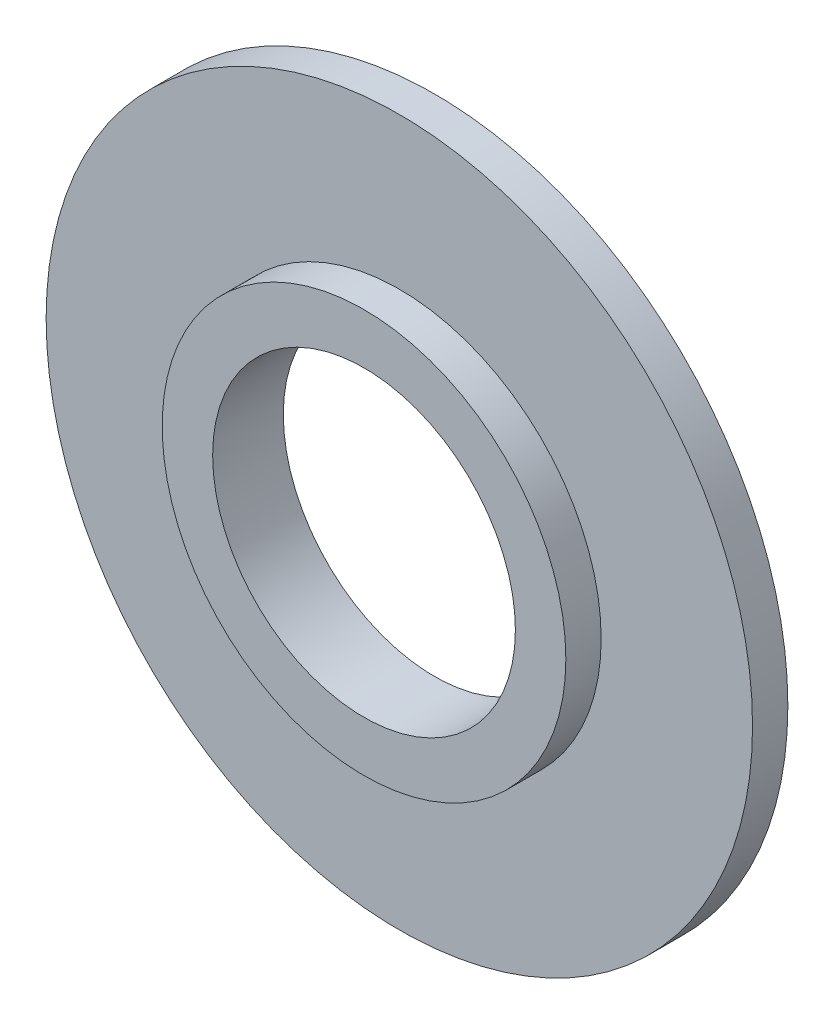
ISO-10303-21;
HEADER;
FILE_DESCRIPTION(('STEP AP214'),'2;1');
FILE_NAME('part.step','',(''),(''),'','','');
FILE_SCHEMA(('AUTOMOTIVE_DESIGN { 1 0 10303 214 1 1 1 1 }'));
ENDSEC;
DATA;
#1=APPLICATION_CONTEXT('core data for automotive mechanical design processes');
#2=APPLICATION_PROTOCOL_DEFINITION('international standard','automotive_design',2000,#1);
#3=PRODUCT_CONTEXT('',#1,'mechanical');
#4=PRODUCT('Part','Part','',(#3));
#5=PRODUCT_RELATED_PRODUCT_CATEGORY('part','',(#4));
#6=PRODUCT_DEFINITION_FORMATION('','',#4);
#7=PRODUCT_DEFINITION_CONTEXT('part definition',#1,'design');
#8=PRODUCT_DEFINITION('design','',#6,#7);
#9=PRODUCT_DEFINITION_SHAPE('','',#8);
#10=(LENGTH_UNIT() NAMED_UNIT(*) SI_UNIT(.MILLI.,.METRE.));
#11=(NAMED_UNIT(*) PLANE_ANGLE_UNIT() SI_UNIT($,.RADIAN.));
#12=(NAMED_UNIT(*) SI_UNIT($,.STERADIAN.) SOLID_ANGLE_UNIT());
#13=UNCERTAINTY_MEASURE_WITH_UNIT(LENGTH_MEASURE(1.E-05),#10,'distance_accuracy_value','');
#14=(GEOMETRIC_REPRESENTATION_CONTEXT(3) GLOBAL_UNCERTAINTY_ASSIGNED_CONTEXT((#13)) GLOBAL_UNIT_ASSIGNED_CONTEXT((#10,
#11,#12)) REPRESENTATION_CONTEXT('',''));
#15=CARTESIAN_POINT('',(0.,0.,0.));
#16=DIRECTION('',(0.,0.,1.));
#17=DIRECTION('',(1.,0.,0.));
#18=AXIS2_PLACEMENT_3D('',#15,#16,#17);
#19=CARTESIAN_POINT('',(0.,0.,-0.7));
#20=DIRECTION('',(0.,0.,1.));
#21=DIRECTION('',(1.,0.,0.));
#22=AXIS2_PLACEMENT_3D('',#19,#20,#21);
#23=CYLINDRICAL_SURFACE('',#22,4.);
#24=CARTESIAN_POINT('',(0.,0.,-0.7));
#25=DIRECTION('',(0.,0.,1.));
#26=DIRECTION('',(1.,0.,0.));
#27=AXIS2_PLACEMENT_3D('',#24,#25,#26);
#28=CIRCLE('',#27,4.);
#29=CARTESIAN_POINT('',(4.,0.,-0.7));
#30=VERTEX_POINT('',#29);
#31=EDGE_CURVE('E43',#30,#30,#28,.T.);
#32=ORIENTED_EDGE('',*,*,#31,.T.);
#33=EDGE_LOOP('',(#32));
#34=FACE_BOUND('',#33,.T.);
#35=CARTESIAN_POINT('',(0.,0.,0.));
#36=DIRECTION('',(0.,0.,1.));
#37=DIRECTION('',(1.,0.,0.));
#38=AXIS2_PLACEMENT_3D('',#35,#36,#37);
#39=CIRCLE('',#38,4.);
#40=CARTESIAN_POINT('',(4.,0.,0.));
#41=VERTEX_POINT('',#40);
#42=EDGE_CURVE('E10',#41,#41,#39,.T.);
#43=ORIENTED_EDGE('',*,*,#42,.F.);
#44=EDGE_LOOP('',(#43));
#45=FACE_BOUND('',#44,.T.);
#46=ADVANCED_FACE('F33',(#34,#45),#23,.T.);
#47=CARTESIAN_POINT('',(0.,0.,0.));
#48=DIRECTION('',(0.,0.,1.));
#49=DIRECTION('',(1.,0.,0.));
#50=AXIS2_PLACEMENT_3D('',#47,#48,#49);
#51=PLANE('',#50);
#52=CARTESIAN_POINT('',(0.,0.,0.));
#53=DIRECTION('',(0.,0.,1.));
#54=DIRECTION('',(1.,0.,0.));
#55=AXIS2_PLACEMENT_3D('',#52,#53,#54);
#56=CIRCLE('',#55,3.);
#57=CARTESIAN_POINT('',(3.,0.,0.));
#58=VERTEX_POINT('',#57);
#59=EDGE_CURVE('E39',#58,#58,#56,.T.);
#60=ORIENTED_EDGE('',*,*,#59,.F.);
#61=EDGE_LOOP('',(#60));
#62=FACE_BOUND('',#61,.T.);
#63=ORIENTED_EDGE('',*,*,#42,.T.);
#64=EDGE_LOOP('',(#63));
#65=FACE_BOUND('',#64,.T.);
#66=ADVANCED_FACE('F73',(#62,#65),#51,.T.);
#67=CARTESIAN_POINT('',(0.,0.,-0.7));
#68=DIRECTION('',(0.,0.,1.));
#69=DIRECTION('',(1.,0.,0.));
#70=AXIS2_PLACEMENT_3D('',#67,#68,#69);
#71=CYLINDRICAL_SURFACE('',#70,3.);
#72=ORIENTED_EDGE('',*,*,#59,.T.);
#73=EDGE_LOOP('',(#72));
#74=FACE_BOUND('',#73,.T.);
#75=CARTESIAN_POINT('',(0.,0.,-1.4));
#76=DIRECTION('',(0.,0.,-1.));
#77=DIRECTION('',(-1.,0.,0.));
#78=AXIS2_PLACEMENT_3D('',#75,#76,#77);
#79=CIRCLE('',#78,3.);
#80=CARTESIAN_POINT('',(-3.,0.,-1.4));
#81=VERTEX_POINT('',#80);
#82=EDGE_CURVE('E53',#81,#81,#79,.T.);
#83=ORIENTED_EDGE('',*,*,#82,.T.);
#84=EDGE_LOOP('',(#83));
#85=FACE_BOUND('',#84,.T.);
#86=ADVANCED_FACE('F59',(#74,#85),#71,.F.);
#87=CARTESIAN_POINT('',(0.,0.,-1.4));
#88=DIRECTION('',(0.,0.,-1.));
#89=DIRECTION('',(-1.,0.,0.));
#90=AXIS2_PLACEMENT_3D('',#87,#88,#89);
#91=PLANE('',#90);
#92=CARTESIAN_POINT('',(0.,0.,-1.4));
#93=DIRECTION('',(0.,0.,-1.));
#94=DIRECTION('',(-1.,0.,0.));
#95=AXIS2_PLACEMENT_3D('',#92,#93,#94);
#96=CIRCLE('',#95,7.);
#97=CARTESIAN_POINT('',(-7.,0.,-1.4));
#98=VERTEX_POINT('',#97);
#99=EDGE_CURVE('E48',#98,#98,#96,.T.);
#100=ORIENTED_EDGE('',*,*,#99,.T.);
#101=EDGE_LOOP('',(#100));
#102=FACE_BOUND('',#101,.T.);
#103=ORIENTED_EDGE('',*,*,#82,.F.);
#104=EDGE_LOOP('',(#103));
#105=FACE_BOUND('',#104,.T.);
#106=ADVANCED_FACE('F61',(#102,#105),#91,.T.);
#107=CARTESIAN_POINT('',(0.,0.,-0.7));
#108=DIRECTION('',(0.,0.,-1.));
#109=DIRECTION('',(-1.,0.,0.));
#110=AXIS2_PLACEMENT_3D('',#107,#108,#109);
#111=PLANE('',#110);
#112=ORIENTED_EDGE('',*,*,#31,.F.);
#113=EDGE_LOOP('',(#112));
#114=FACE_BOUND('',#113,.T.);
#115=CARTESIAN_POINT('',(0.,0.,-0.7));
#116=DIRECTION('',(0.,0.,-1.));
#117=DIRECTION('',(-1.,0.,0.));
#118=AXIS2_PLACEMENT_3D('',#115,#116,#117);
#119=CIRCLE('',#118,7.);
#120=CARTESIAN_POINT('',(-7.,0.,-0.7));
#121=VERTEX_POINT('',#120);
#122=EDGE_CURVE('E50',#121,#121,#119,.T.);
#123=ORIENTED_EDGE('',*,*,#122,.F.);
#124=EDGE_LOOP('',(#123));
#125=FACE_BOUND('',#124,.T.);
#126=ADVANCED_FACE('F63',(#114,#125),#111,.F.);
#127=CARTESIAN_POINT('',(0.,0.,-1.4));
#128=DIRECTION('',(0.,0.,1.));
#129=DIRECTION('',(1.,0.,0.));
#130=AXIS2_PLACEMENT_3D('',#127,#128,#129);
#131=CYLINDRICAL_SURFACE('',#130,7.);
#132=ORIENTED_EDGE('',*,*,#99,.F.);
#133=EDGE_LOOP('',(#132));
#134=FACE_BOUND('',#133,.T.);
#135=ORIENTED_EDGE('',*,*,#122,.T.);
#136=EDGE_LOOP('',(#135));
#137=FACE_BOUND('',#136,.T.);
#138=ADVANCED_FACE('F70',(#134,#137),#131,.T.);
#139=CLOSED_SHELL('',(#46,#66,#86,#106,#126,#138));
#140=MANIFOLD_SOLID_BREP('B2',#139);
#141=ADVANCED_BREP_SHAPE_REPRESENTATION('',(#18,#140),#14);
#142=SHAPE_DEFINITION_REPRESENTATION(#9,#141);
ENDSEC;
END-ISO-10303-21;
